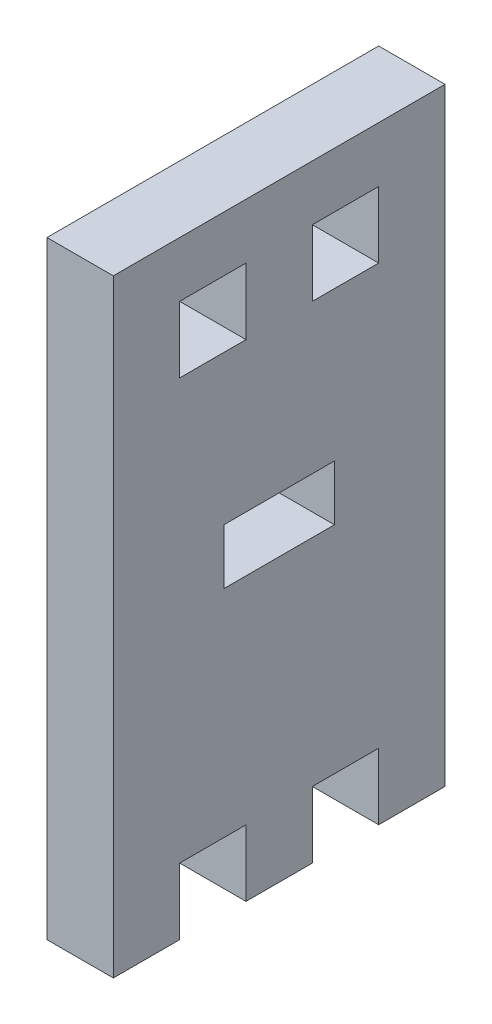
ISO-10303-21;
HEADER;
FILE_DESCRIPTION(('STEP AP214'),'2;1');
FILE_NAME('part.step','',(''),(''),'','','');
FILE_SCHEMA(('AUTOMOTIVE_DESIGN { 1 0 10303 214 1 1 1 1 }'));
ENDSEC;
DATA;
#1=APPLICATION_CONTEXT('core data for automotive mechanical design processes');
#2=APPLICATION_PROTOCOL_DEFINITION('international standard','automotive_design',2000,#1);
#3=PRODUCT_CONTEXT('',#1,'mechanical');
#4=PRODUCT('Part','Part','',(#3));
#5=PRODUCT_RELATED_PRODUCT_CATEGORY('part','',(#4));
#6=PRODUCT_DEFINITION_FORMATION('','',#4);
#7=PRODUCT_DEFINITION_CONTEXT('part definition',#1,'design');
#8=PRODUCT_DEFINITION('design','',#6,#7);
#9=PRODUCT_DEFINITION_SHAPE('','',#8);
#10=(LENGTH_UNIT() NAMED_UNIT(*) SI_UNIT(.MILLI.,.METRE.));
#11=(NAMED_UNIT(*) PLANE_ANGLE_UNIT() SI_UNIT($,.RADIAN.));
#12=(NAMED_UNIT(*) SI_UNIT($,.STERADIAN.) SOLID_ANGLE_UNIT());
#13=UNCERTAINTY_MEASURE_WITH_UNIT(LENGTH_MEASURE(1.E-05),#10,'distance_accuracy_value','');
#14=(GEOMETRIC_REPRESENTATION_CONTEXT(3) GLOBAL_UNCERTAINTY_ASSIGNED_CONTEXT((#13)) GLOBAL_UNIT_ASSIGNED_CONTEXT((#10,
#11,#12)) REPRESENTATION_CONTEXT('',''));
#15=CARTESIAN_POINT('',(0.,0.,0.));
#16=DIRECTION('',(0.,0.,1.));
#17=DIRECTION('',(1.,0.,0.));
#18=AXIS2_PLACEMENT_3D('',#15,#16,#17);
#19=CARTESIAN_POINT('',(6.,-2.00000000000001,0.));
#20=DIRECTION('',(0.,-1.,0.));
#21=DIRECTION('',(0.,0.,-1.));
#22=AXIS2_PLACEMENT_3D('',#19,#20,#21);
#23=PLANE('',#22);
#24=DIRECTION('',(0.,0.,1.));
#25=VECTOR('',#24,1.);
#26=CARTESIAN_POINT('',(0.,-2.00000000000001,0.));
#27=LINE('',#26,#25);
#28=CARTESIAN_POINT('',(0.,-2.00000000000001,-5.));
#29=VERTEX_POINT('',#28);
#30=CARTESIAN_POINT('',(0.,-2.00000000000001,5.));
#31=VERTEX_POINT('',#30);
#32=EDGE_CURVE('E285',#29,#31,#27,.T.);
#33=ORIENTED_EDGE('',*,*,#32,.T.);
#34=DIRECTION('',(-1.,0.,0.));
#35=VECTOR('',#34,1.);
#36=CARTESIAN_POINT('',(6.,-2.00000000000001,5.));
#37=LINE('',#36,#35);
#38=CARTESIAN_POINT('',(6.,-2.00000000000001,5.));
#39=VERTEX_POINT('',#38);
#40=EDGE_CURVE('E11',#39,#31,#37,.T.);
#41=ORIENTED_EDGE('',*,*,#40,.F.);
#42=DIRECTION('',(0.,0.,1.));
#43=VECTOR('',#42,1.);
#44=CARTESIAN_POINT('',(6.,-2.00000000000001,0.));
#45=LINE('',#44,#43);
#46=CARTESIAN_POINT('',(6.,-2.00000000000001,-5.));
#47=VERTEX_POINT('',#46);
#48=EDGE_CURVE('E211',#47,#39,#45,.T.);
#49=ORIENTED_EDGE('',*,*,#48,.F.);
#50=DIRECTION('',(-1.,0.,0.));
#51=VECTOR('',#50,1.);
#52=CARTESIAN_POINT('',(6.,-2.00000000000001,-5.));
#53=LINE('',#52,#51);
#54=EDGE_CURVE('E54',#47,#29,#53,.T.);
#55=ORIENTED_EDGE('',*,*,#54,.T.);
#56=EDGE_LOOP('',(#33,#41,#49,#55));
#57=FACE_BOUND('',#56,.T.);
#58=ADVANCED_FACE('F35',(#57),#23,.F.);
#59=CARTESIAN_POINT('',(6.,0.,5.));
#60=DIRECTION('',(0.,0.,1.));
#61=DIRECTION('',(1.,0.,0.));
#62=AXIS2_PLACEMENT_3D('',#59,#60,#61);
#63=PLANE('',#62);
#64=DIRECTION('',(0.,1.,0.));
#65=VECTOR('',#64,1.);
#66=CARTESIAN_POINT('',(0.,0.,5.));
#67=LINE('',#66,#65);
#68=CARTESIAN_POINT('',(0.,2.99999999999999,5.));
#69=VERTEX_POINT('',#68);
#70=EDGE_CURVE('E217',#31,#69,#67,.T.);
#71=ORIENTED_EDGE('',*,*,#70,.T.);
#72=DIRECTION('',(-1.,0.,0.));
#73=VECTOR('',#72,1.);
#74=CARTESIAN_POINT('',(6.,2.99999999999999,5.));
#75=LINE('',#74,#73);
#76=CARTESIAN_POINT('',(6.,2.99999999999999,5.));
#77=VERTEX_POINT('',#76);
#78=EDGE_CURVE('E45',#77,#69,#75,.T.);
#79=ORIENTED_EDGE('',*,*,#78,.F.);
#80=DIRECTION('',(0.,1.,0.));
#81=VECTOR('',#80,1.);
#82=CARTESIAN_POINT('',(6.,0.,5.));
#83=LINE('',#82,#81);
#84=EDGE_CURVE('E205',#39,#77,#83,.T.);
#85=ORIENTED_EDGE('',*,*,#84,.F.);
#86=ORIENTED_EDGE('',*,*,#40,.T.);
#87=EDGE_LOOP('',(#71,#79,#85,#86));
#88=FACE_BOUND('',#87,.T.);
#89=ADVANCED_FACE('F216',(#88),#63,.F.);
#90=CARTESIAN_POINT('',(6.,2.99999999999999,0.));
#91=DIRECTION('',(0.,-1.,0.));
#92=DIRECTION('',(0.,0.,-1.));
#93=AXIS2_PLACEMENT_3D('',#90,#91,#92);
#94=PLANE('',#93);
#95=DIRECTION('',(0.,0.,1.));
#96=VECTOR('',#95,1.);
#97=CARTESIAN_POINT('',(0.,2.99999999999999,0.));
#98=LINE('',#97,#96);
#99=CARTESIAN_POINT('',(0.,2.99999999999999,-5.));
#100=VERTEX_POINT('',#99);
#101=EDGE_CURVE('E288',#100,#69,#98,.T.);
#102=ORIENTED_EDGE('',*,*,#101,.F.);
#103=DIRECTION('',(-1.,0.,0.));
#104=VECTOR('',#103,1.);
#105=CARTESIAN_POINT('',(6.,2.99999999999999,-5.));
#106=LINE('',#105,#104);
#107=CARTESIAN_POINT('',(6.,2.99999999999999,-5.));
#108=VERTEX_POINT('',#107);
#109=EDGE_CURVE('E128',#108,#100,#106,.T.);
#110=ORIENTED_EDGE('',*,*,#109,.F.);
#111=DIRECTION('',(0.,0.,1.));
#112=VECTOR('',#111,1.);
#113=CARTESIAN_POINT('',(6.,2.99999999999999,0.));
#114=LINE('',#113,#112);
#115=EDGE_CURVE('E210',#108,#77,#114,.T.);
#116=ORIENTED_EDGE('',*,*,#115,.T.);
#117=ORIENTED_EDGE('',*,*,#78,.T.);
#118=EDGE_LOOP('',(#102,#110,#116,#117));
#119=FACE_BOUND('',#118,.T.);
#120=ADVANCED_FACE('F221',(#119),#94,.T.);
#121=CARTESIAN_POINT('',(6.,0.,2.99999999999999));
#122=DIRECTION('',(0.,0.,-1.));
#123=DIRECTION('',(0.,1.,0.));
#124=AXIS2_PLACEMENT_3D('',#121,#122,#123);
#125=PLANE('',#124);
#126=DIRECTION('',(0.,-1.,0.));
#127=VECTOR('',#126,1.);
#128=CARTESIAN_POINT('',(0.,0.,2.99999999999999));
#129=LINE('',#128,#127);
#130=CARTESIAN_POINT('',(0.,-21.5,2.99999999999999));
#131=VERTEX_POINT('',#130);
#132=CARTESIAN_POINT('',(0.,-27.5,2.99999999999999));
#133=VERTEX_POINT('',#132);
#134=EDGE_CURVE('E252',#131,#133,#129,.T.);
#135=ORIENTED_EDGE('',*,*,#134,.T.);
#136=DIRECTION('',(-1.,0.,0.));
#137=VECTOR('',#136,1.);
#138=CARTESIAN_POINT('',(6.,-27.5,2.99999999999999));
#139=LINE('',#138,#137);
#140=CARTESIAN_POINT('',(6.,-27.5,2.99999999999999));
#141=VERTEX_POINT('',#140);
#142=EDGE_CURVE('E295',#141,#133,#139,.T.);
#143=ORIENTED_EDGE('',*,*,#142,.F.);
#144=DIRECTION('',(0.,-1.,0.));
#145=VECTOR('',#144,1.);
#146=CARTESIAN_POINT('',(6.,0.,2.99999999999999));
#147=LINE('',#146,#145);
#148=CARTESIAN_POINT('',(6.,-21.5,2.99999999999999));
#149=VERTEX_POINT('',#148);
#150=EDGE_CURVE('E624',#149,#141,#147,.T.);
#151=ORIENTED_EDGE('',*,*,#150,.F.);
#152=DIRECTION('',(-1.,0.,0.));
#153=VECTOR('',#152,1.);
#154=CARTESIAN_POINT('',(6.,-21.5,2.99999999999999));
#155=LINE('',#154,#153);
#156=EDGE_CURVE('E297',#149,#131,#155,.T.);
#157=ORIENTED_EDGE('',*,*,#156,.T.);
#158=EDGE_LOOP('',(#135,#143,#151,#157));
#159=FACE_BOUND('',#158,.T.);
#160=ADVANCED_FACE('F414',(#159),#125,.F.);
#161=CARTESIAN_POINT('',(6.,-27.5,0.));
#162=DIRECTION('',(0.,1.,0.));
#163=DIRECTION('',(0.,0.,1.));
#164=AXIS2_PLACEMENT_3D('',#161,#162,#163);
#165=PLANE('',#164);
#166=DIRECTION('',(0.,0.,-1.));
#167=VECTOR('',#166,1.);
#168=CARTESIAN_POINT('',(0.,-27.5,0.));
#169=LINE('',#168,#167);
#170=CARTESIAN_POINT('',(0.,-27.5,-2.99999999999999));
#171=VERTEX_POINT('',#170);
#172=EDGE_CURVE('E255',#133,#171,#169,.T.);
#173=ORIENTED_EDGE('',*,*,#172,.T.);
#174=DIRECTION('',(-1.,0.,0.));
#175=VECTOR('',#174,1.);
#176=CARTESIAN_POINT('',(6.,-27.5,-2.99999999999999));
#177=LINE('',#176,#175);
#178=CARTESIAN_POINT('',(6.,-27.5,-2.99999999999999));
#179=VERTEX_POINT('',#178);
#180=EDGE_CURVE('E321',#179,#171,#177,.T.);
#181=ORIENTED_EDGE('',*,*,#180,.F.);
#182=DIRECTION('',(0.,0.,-1.));
#183=VECTOR('',#182,1.);
#184=CARTESIAN_POINT('',(6.,-27.5,0.));
#185=LINE('',#184,#183);
#186=EDGE_CURVE('E622',#141,#179,#185,.T.);
#187=ORIENTED_EDGE('',*,*,#186,.F.);
#188=ORIENTED_EDGE('',*,*,#142,.T.);
#189=EDGE_LOOP('',(#173,#181,#187,#188));
#190=FACE_BOUND('',#189,.T.);
#191=ADVANCED_FACE('F410',(#190),#165,.F.);
#192=CARTESIAN_POINT('',(6.,0.,-2.99999999999999));
#193=DIRECTION('',(0.,0.,-1.));
#194=DIRECTION('',(0.,1.,0.));
#195=AXIS2_PLACEMENT_3D('',#192,#193,#194);
#196=PLANE('',#195);
#197=DIRECTION('',(0.,-1.,0.));
#198=VECTOR('',#197,1.);
#199=CARTESIAN_POINT('',(0.,0.,-2.99999999999999));
#200=LINE('',#199,#198);
#201=CARTESIAN_POINT('',(0.,-21.5,-2.99999999999999));
#202=VERTEX_POINT('',#201);
#203=EDGE_CURVE('E258',#202,#171,#200,.T.);
#204=ORIENTED_EDGE('',*,*,#203,.F.);
#205=DIRECTION('',(-1.,0.,0.));
#206=VECTOR('',#205,1.);
#207=CARTESIAN_POINT('',(6.,-21.5,-2.99999999999999));
#208=LINE('',#207,#206);
#209=CARTESIAN_POINT('',(6.,-21.5,-2.99999999999999));
#210=VERTEX_POINT('',#209);
#211=EDGE_CURVE('E319',#210,#202,#208,.T.);
#212=ORIENTED_EDGE('',*,*,#211,.F.);
#213=DIRECTION('',(0.,-1.,0.));
#214=VECTOR('',#213,1.);
#215=CARTESIAN_POINT('',(6.,0.,-2.99999999999999));
#216=LINE('',#215,#214);
#217=EDGE_CURVE('E619',#210,#179,#216,.T.);
#218=ORIENTED_EDGE('',*,*,#217,.T.);
#219=ORIENTED_EDGE('',*,*,#180,.T.);
#220=EDGE_LOOP('',(#204,#212,#218,#219));
#221=FACE_BOUND('',#220,.T.);
#222=ADVANCED_FACE('F406',(#221),#196,.T.);
#223=CARTESIAN_POINT('',(6.,-21.5,0.));
#224=DIRECTION('',(0.,1.,0.));
#225=DIRECTION('',(0.,0.,1.));
#226=AXIS2_PLACEMENT_3D('',#223,#224,#225);
#227=PLANE('',#226);
#228=DIRECTION('',(0.,0.,-1.));
#229=VECTOR('',#228,1.);
#230=CARTESIAN_POINT('',(0.,-21.5,0.));
#231=LINE('',#230,#229);
#232=CARTESIAN_POINT('',(0.,-21.5,-8.99999999999999));
#233=VERTEX_POINT('',#232);
#234=EDGE_CURVE('E261',#202,#233,#231,.T.);
#235=ORIENTED_EDGE('',*,*,#234,.T.);
#236=DIRECTION('',(-1.,0.,0.));
#237=VECTOR('',#236,1.);
#238=CARTESIAN_POINT('',(6.,-21.5,-8.99999999999999));
#239=LINE('',#238,#237);
#240=CARTESIAN_POINT('',(6.,-21.5,-8.99999999999999));
#241=VERTEX_POINT('',#240);
#242=EDGE_CURVE('E316',#241,#233,#239,.T.);
#243=ORIENTED_EDGE('',*,*,#242,.F.);
#244=DIRECTION('',(0.,0.,-1.));
#245=VECTOR('',#244,1.);
#246=CARTESIAN_POINT('',(6.,-21.5,0.));
#247=LINE('',#246,#245);
#248=EDGE_CURVE('E617',#210,#241,#247,.T.);
#249=ORIENTED_EDGE('',*,*,#248,.F.);
#250=ORIENTED_EDGE('',*,*,#211,.T.);
#251=EDGE_LOOP('',(#235,#243,#249,#250));
#252=FACE_BOUND('',#251,.T.);
#253=ADVANCED_FACE('F402',(#252),#227,.F.);
#254=CARTESIAN_POINT('',(6.,0.,-8.99999999999999));
#255=DIRECTION('',(0.,0.,-1.));
#256=DIRECTION('',(0.,1.,0.));
#257=AXIS2_PLACEMENT_3D('',#254,#255,#256);
#258=PLANE('',#257);
#259=DIRECTION('',(0.,-1.,0.));
#260=VECTOR('',#259,1.);
#261=CARTESIAN_POINT('',(0.,0.,-8.99999999999999));
#262=LINE('',#261,#260);
#263=CARTESIAN_POINT('',(0.,-27.5,-8.99999999999999));
#264=VERTEX_POINT('',#263);
#265=EDGE_CURVE('E263',#233,#264,#262,.T.);
#266=ORIENTED_EDGE('',*,*,#265,.T.);
#267=DIRECTION('',(-1.,0.,0.));
#268=VECTOR('',#267,1.);
#269=CARTESIAN_POINT('',(6.,-27.5,-8.99999999999999));
#270=LINE('',#269,#268);
#271=CARTESIAN_POINT('',(6.,-27.5,-8.99999999999999));
#272=VERTEX_POINT('',#271);
#273=EDGE_CURVE('E313',#272,#264,#270,.T.);
#274=ORIENTED_EDGE('',*,*,#273,.F.);
#275=DIRECTION('',(0.,-1.,0.));
#276=VECTOR('',#275,1.);
#277=CARTESIAN_POINT('',(6.,0.,-8.99999999999999));
#278=LINE('',#277,#276);
#279=EDGE_CURVE('E615',#241,#272,#278,.T.);
#280=ORIENTED_EDGE('',*,*,#279,.F.);
#281=ORIENTED_EDGE('',*,*,#242,.T.);
#282=EDGE_LOOP('',(#266,#274,#280,#281));
#283=FACE_BOUND('',#282,.T.);
#284=ADVANCED_FACE('F398',(#283),#258,.F.);
#285=CARTESIAN_POINT('',(6.,-27.5,0.));
#286=DIRECTION('',(0.,1.,0.));
#287=DIRECTION('',(0.,0.,1.));
#288=AXIS2_PLACEMENT_3D('',#285,#286,#287);
#289=PLANE('',#288);
#290=DIRECTION('',(0.,0.,-1.));
#291=VECTOR('',#290,1.);
#292=CARTESIAN_POINT('',(0.,-27.5,0.));
#293=LINE('',#292,#291);
#294=CARTESIAN_POINT('',(0.,-27.5,-15.));
#295=VERTEX_POINT('',#294);
#296=EDGE_CURVE('E265',#264,#295,#293,.T.);
#297=ORIENTED_EDGE('',*,*,#296,.T.);
#298=DIRECTION('',(-1.,0.,0.));
#299=VECTOR('',#298,1.);
#300=CARTESIAN_POINT('',(6.,-27.5,-15.));
#301=LINE('',#300,#299);
#302=CARTESIAN_POINT('',(6.,-27.5,-15.));
#303=VERTEX_POINT('',#302);
#304=EDGE_CURVE('E311',#303,#295,#301,.T.);
#305=ORIENTED_EDGE('',*,*,#304,.F.);
#306=DIRECTION('',(0.,0.,-1.));
#307=VECTOR('',#306,1.);
#308=CARTESIAN_POINT('',(6.,-27.5,0.));
#309=LINE('',#308,#307);
#310=EDGE_CURVE('E613',#272,#303,#309,.T.);
#311=ORIENTED_EDGE('',*,*,#310,.F.);
#312=ORIENTED_EDGE('',*,*,#273,.T.);
#313=EDGE_LOOP('',(#297,#305,#311,#312));
#314=FACE_BOUND('',#313,.T.);
#315=ADVANCED_FACE('F394',(#314),#289,.F.);
#316=CARTESIAN_POINT('',(6.,0.,-15.));
#317=DIRECTION('',(0.,0.,-1.));
#318=DIRECTION('',(0.,1.,0.));
#319=AXIS2_PLACEMENT_3D('',#316,#317,#318);
#320=PLANE('',#319);
#321=DIRECTION('',(0.,-1.,0.));
#322=VECTOR('',#321,1.);
#323=CARTESIAN_POINT('',(0.,0.,-15.));
#324=LINE('',#323,#322);
#325=CARTESIAN_POINT('',(0.,27.5,-15.));
#326=VERTEX_POINT('',#325);
#327=EDGE_CURVE('E268',#326,#295,#324,.T.);
#328=ORIENTED_EDGE('',*,*,#327,.F.);
#329=DIRECTION('',(-1.,0.,0.));
#330=VECTOR('',#329,1.);
#331=CARTESIAN_POINT('',(6.,27.5,-15.));
#332=LINE('',#331,#330);
#333=CARTESIAN_POINT('',(6.,27.5,-15.));
#334=VERTEX_POINT('',#333);
#335=EDGE_CURVE('E309',#334,#326,#332,.T.);
#336=ORIENTED_EDGE('',*,*,#335,.F.);
#337=DIRECTION('',(0.,-1.,0.));
#338=VECTOR('',#337,1.);
#339=CARTESIAN_POINT('',(6.,0.,-15.));
#340=LINE('',#339,#338);
#341=EDGE_CURVE('E610',#334,#303,#340,.T.);
#342=ORIENTED_EDGE('',*,*,#341,.T.);
#343=ORIENTED_EDGE('',*,*,#304,.T.);
#344=EDGE_LOOP('',(#328,#336,#342,#343));
#345=FACE_BOUND('',#344,.T.);
#346=ADVANCED_FACE('F390',(#345),#320,.T.);
#347=CARTESIAN_POINT('',(6.,27.5,0.));
#348=DIRECTION('',(0.,1.,0.));
#349=DIRECTION('',(0.,0.,1.));
#350=AXIS2_PLACEMENT_3D('',#347,#348,#349);
#351=PLANE('',#350);
#352=DIRECTION('',(0.,0.,-1.));
#353=VECTOR('',#352,1.);
#354=CARTESIAN_POINT('',(0.,27.5,0.));
#355=LINE('',#354,#353);
#356=CARTESIAN_POINT('',(0.,27.5,15.));
#357=VERTEX_POINT('',#356);
#358=EDGE_CURVE('E271',#357,#326,#355,.T.);
#359=ORIENTED_EDGE('',*,*,#358,.F.);
#360=DIRECTION('',(-1.,0.,0.));
#361=VECTOR('',#360,1.);
#362=CARTESIAN_POINT('',(6.,27.5,15.));
#363=LINE('',#362,#361);
#364=CARTESIAN_POINT('',(6.,27.5,15.));
#365=VERTEX_POINT('',#364);
#366=EDGE_CURVE('E307',#365,#357,#363,.T.);
#367=ORIENTED_EDGE('',*,*,#366,.F.);
#368=DIRECTION('',(0.,0.,-1.));
#369=VECTOR('',#368,1.);
#370=CARTESIAN_POINT('',(6.,27.5,0.));
#371=LINE('',#370,#369);
#372=EDGE_CURVE('E607',#365,#334,#371,.T.);
#373=ORIENTED_EDGE('',*,*,#372,.T.);
#374=ORIENTED_EDGE('',*,*,#335,.T.);
#375=EDGE_LOOP('',(#359,#367,#373,#374));
#376=FACE_BOUND('',#375,.T.);
#377=ADVANCED_FACE('F386',(#376),#351,.T.);
#378=CARTESIAN_POINT('',(6.,0.,15.));
#379=DIRECTION('',(0.,0.,-1.));
#380=DIRECTION('',(0.,1.,0.));
#381=AXIS2_PLACEMENT_3D('',#378,#379,#380);
#382=PLANE('',#381);
#383=DIRECTION('',(0.,-1.,0.));
#384=VECTOR('',#383,1.);
#385=CARTESIAN_POINT('',(0.,0.,15.));
#386=LINE('',#385,#384);
#387=CARTESIAN_POINT('',(0.,-27.5,15.));
#388=VERTEX_POINT('',#387);
#389=EDGE_CURVE('E274',#357,#388,#386,.T.);
#390=ORIENTED_EDGE('',*,*,#389,.T.);
#391=DIRECTION('',(-1.,0.,0.));
#392=VECTOR('',#391,1.);
#393=CARTESIAN_POINT('',(6.,-27.5,15.));
#394=LINE('',#393,#392);
#395=CARTESIAN_POINT('',(6.,-27.5,15.));
#396=VERTEX_POINT('',#395);
#397=EDGE_CURVE('E304',#396,#388,#394,.T.);
#398=ORIENTED_EDGE('',*,*,#397,.F.);
#399=DIRECTION('',(0.,-1.,0.));
#400=VECTOR('',#399,1.);
#401=CARTESIAN_POINT('',(6.,0.,15.));
#402=LINE('',#401,#400);
#403=EDGE_CURVE('E605',#365,#396,#402,.T.);
#404=ORIENTED_EDGE('',*,*,#403,.F.);
#405=ORIENTED_EDGE('',*,*,#366,.T.);
#406=EDGE_LOOP('',(#390,#398,#404,#405));
#407=FACE_BOUND('',#406,.T.);
#408=ADVANCED_FACE('F382',(#407),#382,.F.);
#409=CARTESIAN_POINT('',(6.,-27.5,0.));
#410=DIRECTION('',(0.,1.,0.));
#411=DIRECTION('',(0.,0.,1.));
#412=AXIS2_PLACEMENT_3D('',#409,#410,#411);
#413=PLANE('',#412);
#414=DIRECTION('',(0.,0.,-1.));
#415=VECTOR('',#414,1.);
#416=CARTESIAN_POINT('',(0.,-27.5,0.));
#417=LINE('',#416,#415);
#418=CARTESIAN_POINT('',(0.,-27.5,8.99999999999999));
#419=VERTEX_POINT('',#418);
#420=EDGE_CURVE('E276',#388,#419,#417,.T.);
#421=ORIENTED_EDGE('',*,*,#420,.T.);
#422=DIRECTION('',(-1.,0.,0.));
#423=VECTOR('',#422,1.);
#424=CARTESIAN_POINT('',(6.,-27.5,8.99999999999999));
#425=LINE('',#424,#423);
#426=CARTESIAN_POINT('',(6.,-27.5,8.99999999999999));
#427=VERTEX_POINT('',#426);
#428=EDGE_CURVE('E302',#427,#419,#425,.T.);
#429=ORIENTED_EDGE('',*,*,#428,.F.);
#430=DIRECTION('',(0.,0.,-1.));
#431=VECTOR('',#430,1.);
#432=CARTESIAN_POINT('',(6.,-27.5,0.));
#433=LINE('',#432,#431);
#434=EDGE_CURVE('E603',#396,#427,#433,.T.);
#435=ORIENTED_EDGE('',*,*,#434,.F.);
#436=ORIENTED_EDGE('',*,*,#397,.T.);
#437=EDGE_LOOP('',(#421,#429,#435,#436));
#438=FACE_BOUND('',#437,.T.);
#439=ADVANCED_FACE('F378',(#438),#413,.F.);
#440=CARTESIAN_POINT('',(6.,0.,8.99999999999999));
#441=DIRECTION('',(0.,0.,-1.));
#442=DIRECTION('',(0.,1.,0.));
#443=AXIS2_PLACEMENT_3D('',#440,#441,#442);
#444=PLANE('',#443);
#445=DIRECTION('',(0.,-1.,0.));
#446=VECTOR('',#445,1.);
#447=CARTESIAN_POINT('',(0.,0.,8.99999999999999));
#448=LINE('',#447,#446);
#449=CARTESIAN_POINT('',(0.,-21.5,8.99999999999999));
#450=VERTEX_POINT('',#449);
#451=EDGE_CURVE('E279',#450,#419,#448,.T.);
#452=ORIENTED_EDGE('',*,*,#451,.F.);
#453=DIRECTION('',(-1.,0.,0.));
#454=VECTOR('',#453,1.);
#455=CARTESIAN_POINT('',(6.,-21.5,8.99999999999999));
#456=LINE('',#455,#454);
#457=CARTESIAN_POINT('',(6.,-21.5,8.99999999999999));
#458=VERTEX_POINT('',#457);
#459=EDGE_CURVE('E299',#458,#450,#456,.T.);
#460=ORIENTED_EDGE('',*,*,#459,.F.);
#461=DIRECTION('',(0.,-1.,0.));
#462=VECTOR('',#461,1.);
#463=CARTESIAN_POINT('',(6.,0.,8.99999999999999));
#464=LINE('',#463,#462);
#465=EDGE_CURVE('E598',#458,#427,#464,.T.);
#466=ORIENTED_EDGE('',*,*,#465,.T.);
#467=ORIENTED_EDGE('',*,*,#428,.T.);
#468=EDGE_LOOP('',(#452,#460,#466,#467));
#469=FACE_BOUND('',#468,.T.);
#470=ADVANCED_FACE('F374',(#469),#444,.T.);
#471=CARTESIAN_POINT('',(6.,22.5,0.));
#472=DIRECTION('',(0.,1.,0.));
#473=DIRECTION('',(0.,0.,1.));
#474=AXIS2_PLACEMENT_3D('',#471,#472,#473);
#475=PLANE('',#474);
#476=DIRECTION('',(0.,0.,-1.));
#477=VECTOR('',#476,1.);
#478=CARTESIAN_POINT('',(0.,22.5,0.));
#479=LINE('',#478,#477);
#480=CARTESIAN_POINT('',(0.,22.5,9.));
#481=VERTEX_POINT('',#480);
#482=CARTESIAN_POINT('',(0.,22.5,3.));
#483=VERTEX_POINT('',#482);
#484=EDGE_CURVE('E240',#481,#483,#479,.T.);
#485=ORIENTED_EDGE('',*,*,#484,.T.);
#486=DIRECTION('',(-1.,0.,0.));
#487=VECTOR('',#486,1.);
#488=CARTESIAN_POINT('',(6.,22.5,3.));
#489=LINE('',#488,#487);
#490=CARTESIAN_POINT('',(6.,22.5,3.));
#491=VERTEX_POINT('',#490);
#492=EDGE_CURVE('E300',#491,#483,#489,.T.);
#493=ORIENTED_EDGE('',*,*,#492,.F.);
#494=DIRECTION('',(0.,0.,-1.));
#495=VECTOR('',#494,1.);
#496=CARTESIAN_POINT('',(6.,22.5,0.));
#497=LINE('',#496,#495);
#498=CARTESIAN_POINT('',(6.,22.5,9.));
#499=VERTEX_POINT('',#498);
#500=EDGE_CURVE('E635',#499,#491,#497,.T.);
#501=ORIENTED_EDGE('',*,*,#500,.F.);
#502=DIRECTION('',(-1.,0.,0.));
#503=VECTOR('',#502,1.);
#504=CARTESIAN_POINT('',(6.,22.5,9.));
#505=LINE('',#504,#503);
#506=EDGE_CURVE('E325',#499,#481,#505,.T.);
#507=ORIENTED_EDGE('',*,*,#506,.T.);
#508=EDGE_LOOP('',(#485,#493,#501,#507));
#509=FACE_BOUND('',#508,.T.);
#510=ADVANCED_FACE('F377',(#509),#475,.F.);
#511=CARTESIAN_POINT('',(6.,0.,3.));
#512=DIRECTION('',(0.,0.,-1.));
#513=DIRECTION('',(-1.,0.,0.));
#514=AXIS2_PLACEMENT_3D('',#511,#512,#513);
#515=PLANE('',#514);
#516=DIRECTION('',(0.,-1.,0.));
#517=VECTOR('',#516,1.);
#518=CARTESIAN_POINT('',(0.,0.,3.));
#519=LINE('',#518,#517);
#520=CARTESIAN_POINT('',(0.,16.5,3.));
#521=VERTEX_POINT('',#520);
#522=EDGE_CURVE('E243',#483,#521,#519,.T.);
#523=ORIENTED_EDGE('',*,*,#522,.T.);
#524=DIRECTION('',(-1.,0.,0.));
#525=VECTOR('',#524,1.);
#526=CARTESIAN_POINT('',(6.,16.5,3.));
#527=LINE('',#526,#525);
#528=CARTESIAN_POINT('',(6.,16.5,3.));
#529=VERTEX_POINT('',#528);
#530=EDGE_CURVE('E329',#529,#521,#527,.T.);
#531=ORIENTED_EDGE('',*,*,#530,.F.);
#532=DIRECTION('',(0.,-1.,0.));
#533=VECTOR('',#532,1.);
#534=CARTESIAN_POINT('',(6.,0.,3.));
#535=LINE('',#534,#533);
#536=EDGE_CURVE('E633',#491,#529,#535,.T.);
#537=ORIENTED_EDGE('',*,*,#536,.F.);
#538=ORIENTED_EDGE('',*,*,#492,.T.);
#539=EDGE_LOOP('',(#523,#531,#537,#538));
#540=FACE_BOUND('',#539,.T.);
#541=ADVANCED_FACE('F425',(#540),#515,.F.);
#542=CARTESIAN_POINT('',(6.,16.5,0.));
#543=DIRECTION('',(0.,1.,0.));
#544=DIRECTION('',(0.,0.,1.));
#545=AXIS2_PLACEMENT_3D('',#542,#543,#544);
#546=PLANE('',#545);
#547=DIRECTION('',(0.,0.,-1.));
#548=VECTOR('',#547,1.);
#549=CARTESIAN_POINT('',(0.,16.5,0.));
#550=LINE('',#549,#548);
#551=CARTESIAN_POINT('',(0.,16.5,8.99999999999999));
#552=VERTEX_POINT('',#551);
#553=EDGE_CURVE('E246',#552,#521,#550,.T.);
#554=ORIENTED_EDGE('',*,*,#553,.F.);
#555=DIRECTION('',(-1.,0.,0.));
#556=VECTOR('',#555,1.);
#557=CARTESIAN_POINT('',(6.,16.5,8.99999999999999));
#558=LINE('',#557,#556);
#559=CARTESIAN_POINT('',(6.,16.5,8.99999999999999));
#560=VERTEX_POINT('',#559);
#561=EDGE_CURVE('E327',#560,#552,#558,.T.);
#562=ORIENTED_EDGE('',*,*,#561,.F.);
#563=DIRECTION('',(0.,0.,-1.));
#564=VECTOR('',#563,1.);
#565=CARTESIAN_POINT('',(6.,16.5,0.));
#566=LINE('',#565,#564);
#567=EDGE_CURVE('E630',#560,#529,#566,.T.);
#568=ORIENTED_EDGE('',*,*,#567,.T.);
#569=ORIENTED_EDGE('',*,*,#530,.T.);
#570=EDGE_LOOP('',(#554,#562,#568,#569));
#571=FACE_BOUND('',#570,.T.);
#572=ADVANCED_FACE('F422',(#571),#546,.T.);
#573=CARTESIAN_POINT('',(6.,0.,-8.99999999999998));
#574=DIRECTION('',(0.,0.,-1.));
#575=DIRECTION('',(-1.,0.,0.));
#576=AXIS2_PLACEMENT_3D('',#573,#574,#575);
#577=PLANE('',#576);
#578=DIRECTION('',(0.,-1.,0.));
#579=VECTOR('',#578,1.);
#580=CARTESIAN_POINT('',(0.,0.,-8.99999999999998));
#581=LINE('',#580,#579);
#582=CARTESIAN_POINT('',(0.,22.5,-8.99999999999998));
#583=VERTEX_POINT('',#582);
#584=CARTESIAN_POINT('',(0.,16.5,-8.99999999999998));
#585=VERTEX_POINT('',#584);
#586=EDGE_CURVE('E228',#583,#585,#581,.T.);
#587=ORIENTED_EDGE('',*,*,#586,.T.);
#588=DIRECTION('',(-1.,0.,0.));
#589=VECTOR('',#588,1.);
#590=CARTESIAN_POINT('',(6.,16.5,-8.99999999999998));
#591=LINE('',#590,#589);
#592=CARTESIAN_POINT('',(6.,16.5,-8.99999999999998));
#593=VERTEX_POINT('',#592);
#594=EDGE_CURVE('E39',#593,#585,#591,.T.);
#595=ORIENTED_EDGE('',*,*,#594,.F.);
#596=DIRECTION('',(0.,-1.,0.));
#597=VECTOR('',#596,1.);
#598=CARTESIAN_POINT('',(6.,0.,-8.99999999999998));
#599=LINE('',#598,#597);
#600=CARTESIAN_POINT('',(6.,22.5,-8.99999999999998));
#601=VERTEX_POINT('',#600);
#602=EDGE_CURVE('E293',#601,#593,#599,.T.);
#603=ORIENTED_EDGE('',*,*,#602,.F.);
#604=DIRECTION('',(-1.,0.,0.));
#605=VECTOR('',#604,1.);
#606=CARTESIAN_POINT('',(6.,22.5,-8.99999999999998));
#607=LINE('',#606,#605);
#608=EDGE_CURVE('E224',#601,#583,#607,.T.);
#609=ORIENTED_EDGE('',*,*,#608,.T.);
#610=EDGE_LOOP('',(#587,#595,#603,#609));
#611=FACE_BOUND('',#610,.T.);
#612=ADVANCED_FACE('F37',(#611),#577,.F.);
#613=CARTESIAN_POINT('',(6.,16.5,0.));
#614=DIRECTION('',(0.,-1.,0.));
#615=DIRECTION('',(0.,0.,-1.));
#616=AXIS2_PLACEMENT_3D('',#613,#614,#615);
#617=PLANE('',#616);
#618=DIRECTION('',(0.,0.,1.));
#619=VECTOR('',#618,1.);
#620=CARTESIAN_POINT('',(0.,16.5,0.));
#621=LINE('',#620,#619);
#622=CARTESIAN_POINT('',(0.,16.5,-3.00000000000001));
#623=VERTEX_POINT('',#622);
#624=EDGE_CURVE('E231',#585,#623,#621,.T.);
#625=ORIENTED_EDGE('',*,*,#624,.T.);
#626=DIRECTION('',(-1.,0.,0.));
#627=VECTOR('',#626,1.);
#628=CARTESIAN_POINT('',(6.,16.5,-3.00000000000001));
#629=LINE('',#628,#627);
#630=CARTESIAN_POINT('',(6.,16.5,-3.00000000000001));
#631=VERTEX_POINT('',#630);
#632=EDGE_CURVE('E335',#631,#623,#629,.T.);
#633=ORIENTED_EDGE('',*,*,#632,.F.);
#634=DIRECTION('',(0.,0.,1.));
#635=VECTOR('',#634,1.);
#636=CARTESIAN_POINT('',(6.,16.5,0.));
#637=LINE('',#636,#635);
#638=EDGE_CURVE('E141',#593,#631,#637,.T.);
#639=ORIENTED_EDGE('',*,*,#638,.F.);
#640=ORIENTED_EDGE('',*,*,#594,.T.);
#641=EDGE_LOOP('',(#625,#633,#639,#640));
#642=FACE_BOUND('',#641,.T.);
#643=ADVANCED_FACE('F340',(#642),#617,.F.);
#644=CARTESIAN_POINT('',(6.,0.,-3.00000000000001));
#645=DIRECTION('',(0.,0.,-1.));
#646=DIRECTION('',(0.,1.,0.));
#647=AXIS2_PLACEMENT_3D('',#644,#645,#646);
#648=PLANE('',#647);
#649=DIRECTION('',(0.,-1.,0.));
#650=VECTOR('',#649,1.);
#651=CARTESIAN_POINT('',(0.,0.,-3.00000000000001));
#652=LINE('',#651,#650);
#653=CARTESIAN_POINT('',(0.,22.5,-3.00000000000001));
#654=VERTEX_POINT('',#653);
#655=EDGE_CURVE('E234',#654,#623,#652,.T.);
#656=ORIENTED_EDGE('',*,*,#655,.F.);
#657=DIRECTION('',(-1.,0.,0.));
#658=VECTOR('',#657,1.);
#659=CARTESIAN_POINT('',(6.,22.5,-3.00000000000001));
#660=LINE('',#659,#658);
#661=CARTESIAN_POINT('',(6.,22.5,-3.00000000000001));
#662=VERTEX_POINT('',#661);
#663=EDGE_CURVE('E334',#662,#654,#660,.T.);
#664=ORIENTED_EDGE('',*,*,#663,.F.);
#665=DIRECTION('',(0.,-1.,0.));
#666=VECTOR('',#665,1.);
#667=CARTESIAN_POINT('',(6.,0.,-3.00000000000001));
#668=LINE('',#667,#666);
#669=EDGE_CURVE('E639',#662,#631,#668,.T.);
#670=ORIENTED_EDGE('',*,*,#669,.T.);
#671=ORIENTED_EDGE('',*,*,#632,.T.);
#672=EDGE_LOOP('',(#656,#664,#670,#671));
#673=FACE_BOUND('',#672,.T.);
#674=ADVANCED_FACE('F354',(#673),#648,.T.);
#675=CARTESIAN_POINT('',(6.,-21.5,0.));
#676=DIRECTION('',(0.,-1.,0.));
#677=DIRECTION('',(0.,0.,-1.));
#678=AXIS2_PLACEMENT_3D('',#675,#676,#677);
#679=PLANE('',#678);
#680=DIRECTION('',(0.,0.,1.));
#681=VECTOR('',#680,1.);
#682=CARTESIAN_POINT('',(0.,-21.5,0.));
#683=LINE('',#682,#681);
#684=EDGE_CURVE('E282',#131,#450,#683,.T.);
#685=ORIENTED_EDGE('',*,*,#684,.F.);
#686=ORIENTED_EDGE('',*,*,#156,.F.);
#687=DIRECTION('',(0.,0.,1.));
#688=VECTOR('',#687,1.);
#689=CARTESIAN_POINT('',(6.,-21.5,0.));
#690=LINE('',#689,#688);
#691=EDGE_CURVE('E596',#149,#458,#690,.T.);
#692=ORIENTED_EDGE('',*,*,#691,.T.);
#693=ORIENTED_EDGE('',*,*,#459,.T.);
#694=EDGE_LOOP('',(#685,#686,#692,#693));
#695=FACE_BOUND('',#694,.T.);
#696=ADVANCED_FACE('F356',(#695),#679,.T.);
#697=CARTESIAN_POINT('',(6.,0.,8.99999999999998));
#698=DIRECTION('',(0.,0.,-1.));
#699=DIRECTION('',(0.,1.,0.));
#700=AXIS2_PLACEMENT_3D('',#697,#698,#699);
#701=PLANE('',#700);
#702=DIRECTION('',(0.,-1.,0.));
#703=VECTOR('',#702,1.);
#704=CARTESIAN_POINT('',(0.,0.,8.99999999999998));
#705=LINE('',#704,#703);
#706=EDGE_CURVE('E249',#481,#552,#705,.T.);
#707=ORIENTED_EDGE('',*,*,#706,.F.);
#708=ORIENTED_EDGE('',*,*,#506,.F.);
#709=DIRECTION('',(0.,-1.,0.));
#710=VECTOR('',#709,1.);
#711=CARTESIAN_POINT('',(6.,0.,8.99999999999998));
#712=LINE('',#711,#710);
#713=EDGE_CURVE('E627',#499,#560,#712,.T.);
#714=ORIENTED_EDGE('',*,*,#713,.T.);
#715=ORIENTED_EDGE('',*,*,#561,.T.);
#716=EDGE_LOOP('',(#707,#708,#714,#715));
#717=FACE_BOUND('',#716,.T.);
#718=ADVANCED_FACE('F362',(#717),#701,.T.);
#719=CARTESIAN_POINT('',(6.,22.5,0.));
#720=DIRECTION('',(0.,-1.,0.));
#721=DIRECTION('',(0.,0.,-1.));
#722=AXIS2_PLACEMENT_3D('',#719,#720,#721);
#723=PLANE('',#722);
#724=DIRECTION('',(0.,0.,1.));
#725=VECTOR('',#724,1.);
#726=CARTESIAN_POINT('',(0.,22.5,0.));
#727=LINE('',#726,#725);
#728=EDGE_CURVE('E237',#583,#654,#727,.T.);
#729=ORIENTED_EDGE('',*,*,#728,.F.);
#730=ORIENTED_EDGE('',*,*,#608,.F.);
#731=DIRECTION('',(0.,0.,1.));
#732=VECTOR('',#731,1.);
#733=CARTESIAN_POINT('',(6.,22.5,0.));
#734=LINE('',#733,#732);
#735=EDGE_CURVE('E352',#601,#662,#734,.T.);
#736=ORIENTED_EDGE('',*,*,#735,.T.);
#737=ORIENTED_EDGE('',*,*,#663,.T.);
#738=EDGE_LOOP('',(#729,#730,#736,#737));
#739=FACE_BOUND('',#738,.T.);
#740=ADVANCED_FACE('F349',(#739),#723,.T.);
#741=CARTESIAN_POINT('',(6.,0.,-5.));
#742=DIRECTION('',(0.,0.,1.));
#743=DIRECTION('',(1.,0.,0.));
#744=AXIS2_PLACEMENT_3D('',#741,#742,#743);
#745=PLANE('',#744);
#746=DIRECTION('',(0.,1.,0.));
#747=VECTOR('',#746,1.);
#748=CARTESIAN_POINT('',(0.,0.,-5.));
#749=LINE('',#748,#747);
#750=EDGE_CURVE('E290',#29,#100,#749,.T.);
#751=ORIENTED_EDGE('',*,*,#750,.F.);
#752=ORIENTED_EDGE('',*,*,#54,.F.);
#753=DIRECTION('',(0.,1.,0.));
#754=VECTOR('',#753,1.);
#755=CARTESIAN_POINT('',(6.,0.,-5.));
#756=LINE('',#755,#754);
#757=EDGE_CURVE('E222',#47,#108,#756,.T.);
#758=ORIENTED_EDGE('',*,*,#757,.T.);
#759=ORIENTED_EDGE('',*,*,#109,.T.);
#760=EDGE_LOOP('',(#751,#752,#758,#759));
#761=FACE_BOUND('',#760,.T.);
#762=ADVANCED_FACE('F433',(#761),#745,.T.);
#763=CARTESIAN_POINT('',(6.,0.,0.));
#764=DIRECTION('',(1.,0.,0.));
#765=DIRECTION('',(0.,0.,-1.));
#766=AXIS2_PLACEMENT_3D('',#763,#764,#765);
#767=PLANE('',#766);
#768=ORIENTED_EDGE('',*,*,#602,.T.);
#769=ORIENTED_EDGE('',*,*,#638,.T.);
#770=ORIENTED_EDGE('',*,*,#669,.F.);
#771=ORIENTED_EDGE('',*,*,#735,.F.);
#772=EDGE_LOOP('',(#768,#769,#770,#771));
#773=FACE_BOUND('',#772,.T.);
#774=ORIENTED_EDGE('',*,*,#500,.T.);
#775=ORIENTED_EDGE('',*,*,#536,.T.);
#776=ORIENTED_EDGE('',*,*,#567,.F.);
#777=ORIENTED_EDGE('',*,*,#713,.F.);
#778=EDGE_LOOP('',(#774,#775,#776,#777));
#779=FACE_BOUND('',#778,.T.);
#780=ORIENTED_EDGE('',*,*,#150,.T.);
#781=ORIENTED_EDGE('',*,*,#186,.T.);
#782=ORIENTED_EDGE('',*,*,#217,.F.);
#783=ORIENTED_EDGE('',*,*,#248,.T.);
#784=ORIENTED_EDGE('',*,*,#279,.T.);
#785=ORIENTED_EDGE('',*,*,#310,.T.);
#786=ORIENTED_EDGE('',*,*,#341,.F.);
#787=ORIENTED_EDGE('',*,*,#372,.F.);
#788=ORIENTED_EDGE('',*,*,#403,.T.);
#789=ORIENTED_EDGE('',*,*,#434,.T.);
#790=ORIENTED_EDGE('',*,*,#465,.F.);
#791=ORIENTED_EDGE('',*,*,#691,.F.);
#792=EDGE_LOOP('',(#780,#781,#782,#783,#784,#785,#786,#787,#788,#789,#790,#791));
#793=FACE_BOUND('',#792,.T.);
#794=ORIENTED_EDGE('',*,*,#48,.T.);
#795=ORIENTED_EDGE('',*,*,#84,.T.);
#796=ORIENTED_EDGE('',*,*,#115,.F.);
#797=ORIENTED_EDGE('',*,*,#757,.F.);
#798=EDGE_LOOP('',(#794,#795,#796,#797));
#799=FACE_BOUND('',#798,.T.);
#800=ADVANCED_FACE('F207',(#773,#779,#793,#799),#767,.T.);
#801=CARTESIAN_POINT('',(0.,0.,0.));
#802=DIRECTION('',(1.,0.,0.));
#803=DIRECTION('',(0.,0.,-1.));
#804=AXIS2_PLACEMENT_3D('',#801,#802,#803);
#805=PLANE('',#804);
#806=ORIENTED_EDGE('',*,*,#586,.F.);
#807=ORIENTED_EDGE('',*,*,#728,.T.);
#808=ORIENTED_EDGE('',*,*,#655,.T.);
#809=ORIENTED_EDGE('',*,*,#624,.F.);
#810=EDGE_LOOP('',(#806,#807,#808,#809));
#811=FACE_BOUND('',#810,.T.);
#812=ORIENTED_EDGE('',*,*,#484,.F.);
#813=ORIENTED_EDGE('',*,*,#706,.T.);
#814=ORIENTED_EDGE('',*,*,#553,.T.);
#815=ORIENTED_EDGE('',*,*,#522,.F.);
#816=EDGE_LOOP('',(#812,#813,#814,#815));
#817=FACE_BOUND('',#816,.T.);
#818=ORIENTED_EDGE('',*,*,#134,.F.);
#819=ORIENTED_EDGE('',*,*,#684,.T.);
#820=ORIENTED_EDGE('',*,*,#451,.T.);
#821=ORIENTED_EDGE('',*,*,#420,.F.);
#822=ORIENTED_EDGE('',*,*,#389,.F.);
#823=ORIENTED_EDGE('',*,*,#358,.T.);
#824=ORIENTED_EDGE('',*,*,#327,.T.);
#825=ORIENTED_EDGE('',*,*,#296,.F.);
#826=ORIENTED_EDGE('',*,*,#265,.F.);
#827=ORIENTED_EDGE('',*,*,#234,.F.);
#828=ORIENTED_EDGE('',*,*,#203,.T.);
#829=ORIENTED_EDGE('',*,*,#172,.F.);
#830=EDGE_LOOP('',(#818,#819,#820,#821,#822,#823,#824,#825,#826,#827,#828,#829));
#831=FACE_BOUND('',#830,.T.);
#832=ORIENTED_EDGE('',*,*,#32,.F.);
#833=ORIENTED_EDGE('',*,*,#750,.T.);
#834=ORIENTED_EDGE('',*,*,#101,.T.);
#835=ORIENTED_EDGE('',*,*,#70,.F.);
#836=EDGE_LOOP('',(#832,#833,#834,#835));
#837=FACE_BOUND('',#836,.T.);
#838=ADVANCED_FACE('F346',(#811,#817,#831,#837),#805,.F.);
#839=CLOSED_SHELL('',(#58,#89,#120,#160,#191,#222,#253,#284,#315,#346,#377,#408,#439,#470,#510,
#541,#572,#612,#643,#674,#696,#718,#740,#762,#800,#838));
#840=MANIFOLD_SOLID_BREP('B2',#839);
#841=ADVANCED_BREP_SHAPE_REPRESENTATION('',(#18,#840),#14);
#842=SHAPE_DEFINITION_REPRESENTATION(#9,#841);
ENDSEC;
END-ISO-10303-21;
